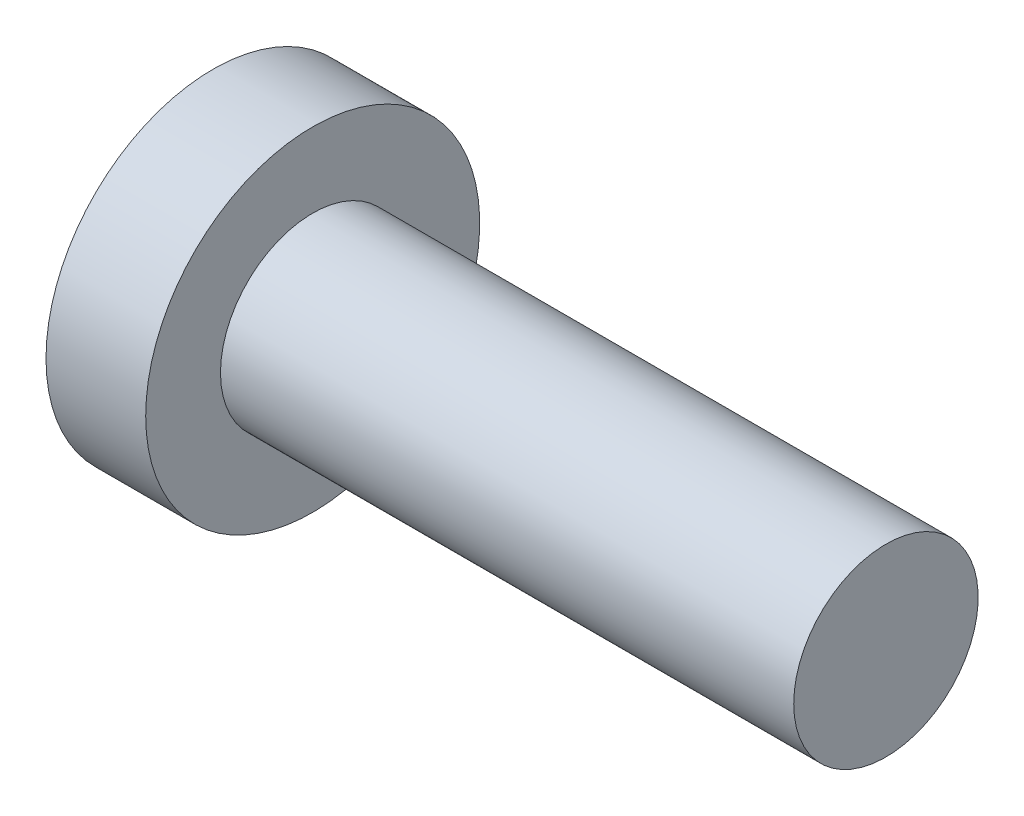
ISO-10303-21;
HEADER;
FILE_DESCRIPTION(('STEP AP214'),'2;1');
FILE_NAME('part.step','',(''),(''),'','','');
FILE_SCHEMA(('AUTOMOTIVE_DESIGN { 1 0 10303 214 1 1 1 1 }'));
ENDSEC;
DATA;
#1=APPLICATION_CONTEXT('core data for automotive mechanical design processes');
#2=APPLICATION_PROTOCOL_DEFINITION('international standard','automotive_design',2000,#1);
#3=PRODUCT_CONTEXT('',#1,'mechanical');
#4=PRODUCT('Part','Part','',(#3));
#5=PRODUCT_RELATED_PRODUCT_CATEGORY('part','',(#4));
#6=PRODUCT_DEFINITION_FORMATION('','',#4);
#7=PRODUCT_DEFINITION_CONTEXT('part definition',#1,'design');
#8=PRODUCT_DEFINITION('design','',#6,#7);
#9=PRODUCT_DEFINITION_SHAPE('','',#8);
#10=(LENGTH_UNIT() NAMED_UNIT(*) SI_UNIT(.MILLI.,.METRE.));
#11=(NAMED_UNIT(*) PLANE_ANGLE_UNIT() SI_UNIT($,.RADIAN.));
#12=(NAMED_UNIT(*) SI_UNIT($,.STERADIAN.) SOLID_ANGLE_UNIT());
#13=UNCERTAINTY_MEASURE_WITH_UNIT(LENGTH_MEASURE(1.E-05),#10,'distance_accuracy_value','');
#14=(GEOMETRIC_REPRESENTATION_CONTEXT(3) GLOBAL_UNCERTAINTY_ASSIGNED_CONTEXT((#13)) GLOBAL_UNIT_ASSIGNED_CONTEXT((#10,
#11,#12)) REPRESENTATION_CONTEXT('',''));
#15=CARTESIAN_POINT('',(0.,0.,0.));
#16=DIRECTION('',(0.,0.,1.));
#17=DIRECTION('',(1.,0.,0.));
#18=AXIS2_PLACEMENT_3D('',#15,#16,#17);
#19=CARTESIAN_POINT('',(-13.5,0.,0.));
#20=DIRECTION('',(1.,0.,0.));
#21=DIRECTION('',(0.,0.,-1.));
#22=AXIS2_PLACEMENT_3D('',#19,#20,#21);
#23=PLANE('',#22);
#24=CARTESIAN_POINT('',(-13.5,0.,0.));
#25=DIRECTION('',(-1.,0.,0.));
#26=DIRECTION('',(0.,0.,1.));
#27=AXIS2_PLACEMENT_3D('',#24,#25,#26);
#28=CIRCLE('',#27,6.7);
#29=CARTESIAN_POINT('',(-13.5,0.,6.7));
#30=VERTEX_POINT('',#29);
#31=EDGE_CURVE('E10',#30,#30,#28,.T.);
#32=ORIENTED_EDGE('',*,*,#31,.T.);
#33=EDGE_LOOP('',(#32));
#34=FACE_BOUND('',#33,.T.);
#35=ADVANCED_FACE('F34',(#34),#23,.F.);
#36=CARTESIAN_POINT('',(0.,0.,0.));
#37=DIRECTION('',(-1.,0.,0.));
#38=DIRECTION('',(0.,0.,1.));
#39=AXIS2_PLACEMENT_3D('',#36,#37,#38);
#40=CYLINDRICAL_SURFACE('',#39,6.7);
#41=ORIENTED_EDGE('',*,*,#31,.F.);
#42=EDGE_LOOP('',(#41));
#43=FACE_BOUND('',#42,.T.);
#44=CARTESIAN_POINT('',(-9.5,0.,0.));
#45=DIRECTION('',(-1.,0.,0.));
#46=DIRECTION('',(0.,0.,1.));
#47=AXIS2_PLACEMENT_3D('',#44,#45,#46);
#48=CIRCLE('',#47,6.7);
#49=CARTESIAN_POINT('',(-9.5,0.,6.7));
#50=VERTEX_POINT('',#49);
#51=EDGE_CURVE('E40',#50,#50,#48,.T.);
#52=ORIENTED_EDGE('',*,*,#51,.T.);
#53=EDGE_LOOP('',(#52));
#54=FACE_BOUND('',#53,.T.);
#55=ADVANCED_FACE('F66',(#43,#54),#40,.T.);
#56=CARTESIAN_POINT('',(-9.5,6.7,0.));
#57=DIRECTION('',(-1.,0.,0.));
#58=DIRECTION('',(0.,0.,1.));
#59=AXIS2_PLACEMENT_3D('',#56,#57,#58);
#60=PLANE('',#59);
#61=ORIENTED_EDGE('',*,*,#51,.F.);
#62=EDGE_LOOP('',(#61));
#63=FACE_BOUND('',#62,.T.);
#64=CARTESIAN_POINT('',(-9.5,0.,0.));
#65=DIRECTION('',(-1.,0.,0.));
#66=DIRECTION('',(0.,0.,1.));
#67=AXIS2_PLACEMENT_3D('',#64,#65,#66);
#68=CIRCLE('',#67,3.7);
#69=CARTESIAN_POINT('',(-9.5,0.,3.7));
#70=VERTEX_POINT('',#69);
#71=EDGE_CURVE('E44',#70,#70,#68,.T.);
#72=ORIENTED_EDGE('',*,*,#71,.T.);
#73=EDGE_LOOP('',(#72));
#74=FACE_BOUND('',#73,.T.);
#75=ADVANCED_FACE('F62',(#63,#74),#60,.F.);
#76=CARTESIAN_POINT('',(0.,0.,0.));
#77=DIRECTION('',(-1.,0.,0.));
#78=DIRECTION('',(0.,0.,1.));
#79=AXIS2_PLACEMENT_3D('',#76,#77,#78);
#80=CYLINDRICAL_SURFACE('',#79,3.7);
#81=ORIENTED_EDGE('',*,*,#71,.F.);
#82=EDGE_LOOP('',(#81));
#83=FACE_BOUND('',#82,.T.);
#84=CARTESIAN_POINT('',(13.5,0.,0.));
#85=DIRECTION('',(-1.,0.,0.));
#86=DIRECTION('',(0.,0.,1.));
#87=AXIS2_PLACEMENT_3D('',#84,#85,#86);
#88=CIRCLE('',#87,3.7);
#89=CARTESIAN_POINT('',(13.5,0.,3.7));
#90=VERTEX_POINT('',#89);
#91=EDGE_CURVE('E48',#90,#90,#88,.T.);
#92=ORIENTED_EDGE('',*,*,#91,.T.);
#93=EDGE_LOOP('',(#92));
#94=FACE_BOUND('',#93,.T.);
#95=ADVANCED_FACE('F54',(#83,#94),#80,.T.);
#96=CARTESIAN_POINT('',(13.5,3.7,0.));
#97=DIRECTION('',(-1.,0.,0.));
#98=DIRECTION('',(0.,0.,1.));
#99=AXIS2_PLACEMENT_3D('',#96,#97,#98);
#100=PLANE('',#99);
#101=ORIENTED_EDGE('',*,*,#91,.F.);
#102=EDGE_LOOP('',(#101));
#103=FACE_BOUND('',#102,.T.);
#104=ADVANCED_FACE('F56',(#103),#100,.F.);
#105=CLOSED_SHELL('',(#35,#55,#75,#95,#104));
#106=MANIFOLD_SOLID_BREP('B2',#105);
#107=ADVANCED_BREP_SHAPE_REPRESENTATION('',(#18,#106),#14);
#108=SHAPE_DEFINITION_REPRESENTATION(#9,#107);
ENDSEC;
END-ISO-10303-21;
